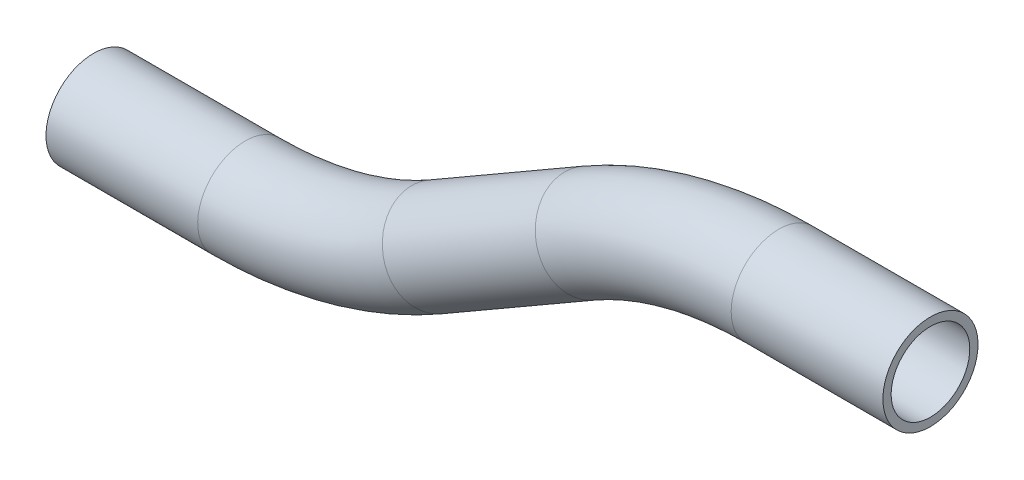
ISO-10303-21;
HEADER;
FILE_DESCRIPTION(('STEP AP214'),'2;1');
FILE_NAME('part.step','',(''),(''),'','','');
FILE_SCHEMA(('AUTOMOTIVE_DESIGN { 1 0 10303 214 1 1 1 1 }'));
ENDSEC;
DATA;
#1=APPLICATION_CONTEXT('core data for automotive mechanical design processes');
#2=APPLICATION_PROTOCOL_DEFINITION('international standard','automotive_design',2000,#1);
#3=PRODUCT_CONTEXT('',#1,'mechanical');
#4=PRODUCT('Part','Part','',(#3));
#5=PRODUCT_RELATED_PRODUCT_CATEGORY('part','',(#4));
#6=PRODUCT_DEFINITION_FORMATION('','',#4);
#7=PRODUCT_DEFINITION_CONTEXT('part definition',#1,'design');
#8=PRODUCT_DEFINITION('design','',#6,#7);
#9=PRODUCT_DEFINITION_SHAPE('','',#8);
#10=(LENGTH_UNIT() NAMED_UNIT(*) SI_UNIT(.MILLI.,.METRE.));
#11=(NAMED_UNIT(*) PLANE_ANGLE_UNIT() SI_UNIT($,.RADIAN.));
#12=(NAMED_UNIT(*) SI_UNIT($,.STERADIAN.) SOLID_ANGLE_UNIT());
#13=UNCERTAINTY_MEASURE_WITH_UNIT(LENGTH_MEASURE(1.E-05),#10,'distance_accuracy_value','');
#14=(GEOMETRIC_REPRESENTATION_CONTEXT(3) GLOBAL_UNCERTAINTY_ASSIGNED_CONTEXT((#13)) GLOBAL_UNIT_ASSIGNED_CONTEXT((#10,
#11,#12)) REPRESENTATION_CONTEXT('',''));
#15=CARTESIAN_POINT('',(0.,0.,0.));
#16=DIRECTION('',(0.,0.,1.));
#17=DIRECTION('',(1.,0.,0.));
#18=AXIS2_PLACEMENT_3D('',#15,#16,#17);
#19=CARTESIAN_POINT('',(30.3822715367483,0.,0.));
#20=DIRECTION('',(-1.,0.,0.));
#21=DIRECTION('',(0.,-1.,0.));
#22=AXIS2_PLACEMENT_3D('',#19,#20,#21);
#23=CYLINDRICAL_SURFACE('',#22,9.525);
#24=CARTESIAN_POINT('',(0.,0.,0.));
#25=DIRECTION('',(-1.,0.,0.));
#26=DIRECTION('',(0.,-1.,0.));
#27=AXIS2_PLACEMENT_3D('',#24,#25,#26);
#28=CIRCLE('',#27,9.525);
#29=CARTESIAN_POINT('',(0.,9.52499999999999,0.));
#30=VERTEX_POINT('',#29);
#31=EDGE_CURVE('E67',#30,#30,#28,.T.);
#32=ORIENTED_EDGE('',*,*,#31,.F.);
#33=EDGE_LOOP('',(#32));
#34=FACE_BOUND('',#33,.T.);
#35=CARTESIAN_POINT('',(30.3822715367483,0.,0.));
#36=DIRECTION('',(-1.,0.,0.));
#37=DIRECTION('',(0.,-1.,0.));
#38=AXIS2_PLACEMENT_3D('',#35,#36,#37);
#39=CIRCLE('',#38,9.525);
#40=CARTESIAN_POINT('',(30.3822715367483,-9.525,0.));
#41=VERTEX_POINT('',#40);
#42=EDGE_CURVE('E63',#41,#41,#39,.T.);
#43=ORIENTED_EDGE('',*,*,#42,.T.);
#44=EDGE_LOOP('',(#43));
#45=FACE_BOUND('',#44,.T.);
#46=ADVANCED_FACE('F39',(#34,#45),#23,.T.);
#47=CARTESIAN_POINT('',(0.,-76.2,0.));
#48=DIRECTION('',(0.,0.,1.));
#49=DIRECTION('',(1.,0.,0.));
#50=AXIS2_PLACEMENT_3D('',#47,#48,#49);
#51=TOROIDAL_SURFACE('',#50,76.2,9.525);
#52=CARTESIAN_POINT('',(-38.1000000000001,-10.2088642316259,0.));
#53=DIRECTION('',(-0.866025403784438,-0.500000000000002,0.));
#54=DIRECTION('',(0.500000000000002,-0.866025403784438,0.));
#55=AXIS2_PLACEMENT_3D('',#52,#53,#54);
#56=CIRCLE('',#55,9.525);
#57=CARTESIAN_POINT('',(-42.8625000000002,-1.95997226057908,0.));
#58=VERTEX_POINT('',#57);
#59=EDGE_CURVE('E71',#58,#58,#56,.T.);
#60=CARTESIAN_POINT('',(0.,-76.2,0.));
#61=DIRECTION('',(0.,0.,1.));
#62=DIRECTION('',(1.,0.,0.));
#63=AXIS2_PLACEMENT_3D('',#60,#61,#62);
#64=CIRCLE('',#63,85.725);
#65=EDGE_CURVE('',#30,#58,#64,.T.);
#66=ORIENTED_EDGE('',*,*,#31,.T.);
#67=ORIENTED_EDGE('',*,*,#59,.F.);
#68=ORIENTED_EDGE('',*,*,#65,.T.);
#69=ORIENTED_EDGE('',*,*,#65,.F.);
#70=EDGE_LOOP('',(#66,#68,#67,#69));
#71=FACE_BOUND('',#70,.T.);
#72=ADVANCED_FACE('F93',(#71),#51,.T.);
#73=CARTESIAN_POINT('',(-38.1000000000001,-10.2088642316259,0.));
#74=DIRECTION('',(-0.866025403784438,-0.500000000000001,0.));
#75=DIRECTION('',(0.500000000000001,-0.866025403784438,0.));
#76=AXIS2_PLACEMENT_3D('',#73,#74,#75);
#77=CYLINDRICAL_SURFACE('',#76,9.525);
#78=CARTESIAN_POINT('',(-68.7265926948774,-27.8911357683743,0.));
#79=DIRECTION('',(-0.866025403784438,-0.500000000000001,0.));
#80=DIRECTION('',(0.500000000000001,-0.866025403784438,0.));
#81=AXIS2_PLACEMENT_3D('',#78,#79,#80);
#82=CIRCLE('',#81,9.525);
#83=CARTESIAN_POINT('',(-63.9640926948773,-36.1400277394211,0.));
#84=VERTEX_POINT('',#83);
#85=EDGE_CURVE('E74',#84,#84,#82,.T.);
#86=ORIENTED_EDGE('',*,*,#85,.F.);
#87=EDGE_LOOP('',(#86));
#88=FACE_BOUND('',#87,.T.);
#89=ORIENTED_EDGE('',*,*,#59,.T.);
#90=EDGE_LOOP('',(#89));
#91=FACE_BOUND('',#90,.T.);
#92=ADVANCED_FACE('F86',(#88,#91),#77,.T.);
#93=CARTESIAN_POINT('',(-106.826592694877,38.0999999999999,0.));
#94=DIRECTION('',(0.,0.,-1.));
#95=DIRECTION('',(-1.,0.,0.));
#96=AXIS2_PLACEMENT_3D('',#93,#94,#95);
#97=TOROIDAL_SURFACE('',#96,76.2,9.525);
#98=CARTESIAN_POINT('',(-106.826592694877,-38.1000000000002,0.));
#99=DIRECTION('',(-1.,0.,0.));
#100=DIRECTION('',(0.,-1.,0.));
#101=AXIS2_PLACEMENT_3D('',#98,#99,#100);
#102=CIRCLE('',#101,9.525);
#103=CARTESIAN_POINT('',(-106.826592694877,-47.6250000000001,0.));
#104=VERTEX_POINT('',#103);
#105=EDGE_CURVE('E43',#104,#104,#102,.T.);
#106=CARTESIAN_POINT('',(-106.826592694877,38.0999999999999,0.));
#107=DIRECTION('',(0.,0.,-1.));
#108=DIRECTION('',(-1.,0.,0.));
#109=AXIS2_PLACEMENT_3D('',#106,#107,#108);
#110=CIRCLE('',#109,85.725);
#111=EDGE_CURVE('',#84,#104,#110,.T.);
#112=ORIENTED_EDGE('',*,*,#85,.T.);
#113=ORIENTED_EDGE('',*,*,#105,.F.);
#114=ORIENTED_EDGE('',*,*,#111,.T.);
#115=ORIENTED_EDGE('',*,*,#111,.F.);
#116=EDGE_LOOP('',(#112,#114,#113,#115));
#117=FACE_BOUND('',#116,.T.);
#118=ADVANCED_FACE('F84',(#117),#97,.T.);
#119=CARTESIAN_POINT('',(-106.826592694877,-38.1000000000002,0.));
#120=DIRECTION('',(-1.,0.,0.));
#121=DIRECTION('',(0.,-1.,0.));
#122=AXIS2_PLACEMENT_3D('',#119,#120,#121);
#123=CYLINDRICAL_SURFACE('',#122,9.525);
#124=CARTESIAN_POINT('',(-137.208864231626,-38.1000000000002,0.));
#125=DIRECTION('',(-1.,0.,0.));
#126=DIRECTION('',(0.,-1.,0.));
#127=AXIS2_PLACEMENT_3D('',#124,#125,#126);
#128=CIRCLE('',#127,9.525);
#129=CARTESIAN_POINT('',(-137.208864231626,-47.6250000000002,0.));
#130=VERTEX_POINT('',#129);
#131=EDGE_CURVE('E58',#130,#130,#128,.T.);
#132=ORIENTED_EDGE('',*,*,#131,.F.);
#133=EDGE_LOOP('',(#132));
#134=FACE_BOUND('',#133,.T.);
#135=ORIENTED_EDGE('',*,*,#105,.T.);
#136=EDGE_LOOP('',(#135));
#137=FACE_BOUND('',#136,.T.);
#138=ADVANCED_FACE('F41',(#134,#137),#123,.T.);
#139=CARTESIAN_POINT('',(30.3822715367483,0.,0.));
#140=DIRECTION('',(-1.,0.,0.));
#141=DIRECTION('',(0.,-1.,0.));
#142=AXIS2_PLACEMENT_3D('',#139,#140,#141);
#143=PLANE('',#142);
#144=CARTESIAN_POINT('',(30.3822715367483,0.,0.));
#145=DIRECTION('',(-1.,0.,0.));
#146=DIRECTION('',(0.,-1.,0.));
#147=AXIS2_PLACEMENT_3D('',#144,#145,#146);
#148=CIRCLE('',#147,7.874);
#149=CARTESIAN_POINT('',(30.3822715367483,-7.874,0.));
#150=VERTEX_POINT('',#149);
#151=EDGE_CURVE('E62',#150,#150,#148,.F.);
#152=ORIENTED_EDGE('',*,*,#151,.F.);
#153=EDGE_LOOP('',(#152));
#154=FACE_BOUND('',#153,.T.);
#155=ORIENTED_EDGE('',*,*,#42,.F.);
#156=EDGE_LOOP('',(#155));
#157=FACE_BOUND('',#156,.T.);
#158=ADVANCED_FACE('F91',(#154,#157),#143,.F.);
#159=CARTESIAN_POINT('',(-137.208864231626,-38.1000000000002,0.));
#160=DIRECTION('',(-1.,0.,0.));
#161=DIRECTION('',(0.,-1.,0.));
#162=AXIS2_PLACEMENT_3D('',#159,#160,#161);
#163=PLANE('',#162);
#164=CARTESIAN_POINT('',(-137.208864231626,-38.1000000000002,0.));
#165=DIRECTION('',(-1.,0.,0.));
#166=DIRECTION('',(0.,-1.,0.));
#167=AXIS2_PLACEMENT_3D('',#164,#165,#166);
#168=CIRCLE('',#167,7.874);
#169=CARTESIAN_POINT('',(-137.208864231626,-45.9740000000002,0.));
#170=VERTEX_POINT('',#169);
#171=EDGE_CURVE('E10',#170,#170,#168,.F.);
#172=ORIENTED_EDGE('',*,*,#171,.T.);
#173=EDGE_LOOP('',(#172));
#174=FACE_BOUND('',#173,.T.);
#175=ORIENTED_EDGE('',*,*,#131,.T.);
#176=EDGE_LOOP('',(#175));
#177=FACE_BOUND('',#176,.T.);
#178=ADVANCED_FACE('F110',(#174,#177),#163,.T.);
#179=CARTESIAN_POINT('',(30.3822715367483,0.,0.));
#180=DIRECTION('',(-1.,0.,0.));
#181=DIRECTION('',(0.,-1.,0.));
#182=AXIS2_PLACEMENT_3D('',#179,#180,#181);
#183=CYLINDRICAL_SURFACE('',#182,7.874);
#184=CARTESIAN_POINT('',(0.,0.,0.));
#185=DIRECTION('',(-1.,0.,0.));
#186=DIRECTION('',(0.,-1.,0.));
#187=AXIS2_PLACEMENT_3D('',#184,#185,#186);
#188=CIRCLE('',#187,7.874);
#189=CARTESIAN_POINT('',(0.,7.87399999999999,0.));
#190=VERTEX_POINT('',#189);
#191=EDGE_CURVE('E209',#190,#190,#188,.F.);
#192=ORIENTED_EDGE('',*,*,#191,.F.);
#193=EDGE_LOOP('',(#192));
#194=FACE_BOUND('',#193,.T.);
#195=ORIENTED_EDGE('',*,*,#151,.T.);
#196=EDGE_LOOP('',(#195));
#197=FACE_BOUND('',#196,.T.);
#198=ADVANCED_FACE('F113',(#194,#197),#183,.F.);
#199=CARTESIAN_POINT('',(0.,-76.2,0.));
#200=DIRECTION('',(0.,0.,1.));
#201=DIRECTION('',(1.,0.,0.));
#202=AXIS2_PLACEMENT_3D('',#199,#200,#201);
#203=TOROIDAL_SURFACE('',#202,76.2,7.874);
#204=CARTESIAN_POINT('',(-38.1000000000001,-10.2088642316259,0.));
#205=DIRECTION('',(-0.866025403784438,-0.500000000000002,0.));
#206=DIRECTION('',(0.500000000000002,-0.866025403784438,0.));
#207=AXIS2_PLACEMENT_3D('',#204,#205,#206);
#208=CIRCLE('',#207,7.874);
#209=CARTESIAN_POINT('',(-42.0370000000001,-3.38978020222719,0.));
#210=VERTEX_POINT('',#209);
#211=EDGE_CURVE('E207',#210,#210,#208,.F.);
#212=CARTESIAN_POINT('',(0.,-76.2,0.));
#213=DIRECTION('',(0.,0.,1.));
#214=DIRECTION('',(1.,0.,0.));
#215=AXIS2_PLACEMENT_3D('',#212,#213,#214);
#216=CIRCLE('',#215,84.074);
#217=EDGE_CURVE('',#190,#210,#216,.T.);
#218=ORIENTED_EDGE('',*,*,#191,.T.);
#219=ORIENTED_EDGE('',*,*,#211,.F.);
#220=ORIENTED_EDGE('',*,*,#217,.T.);
#221=ORIENTED_EDGE('',*,*,#217,.F.);
#222=EDGE_LOOP('',(#218,#220,#219,#221));
#223=FACE_BOUND('',#222,.T.);
#224=ADVANCED_FACE('F170',(#223),#203,.F.);
#225=CARTESIAN_POINT('',(-38.1000000000001,-10.2088642316259,0.));
#226=DIRECTION('',(-0.866025403784438,-0.500000000000001,0.));
#227=DIRECTION('',(0.500000000000001,-0.866025403784438,0.));
#228=AXIS2_PLACEMENT_3D('',#225,#226,#227);
#229=CYLINDRICAL_SURFACE('',#228,7.874);
#230=CARTESIAN_POINT('',(-68.7265926948774,-27.8911357683743,0.));
#231=DIRECTION('',(-0.866025403784438,-0.500000000000001,0.));
#232=DIRECTION('',(0.500000000000001,-0.866025403784438,0.));
#233=AXIS2_PLACEMENT_3D('',#230,#231,#232);
#234=CIRCLE('',#233,7.874);
#235=CARTESIAN_POINT('',(-64.7895926948773,-34.710219797773,0.));
#236=VERTEX_POINT('',#235);
#237=EDGE_CURVE('E54',#236,#236,#234,.F.);
#238=ORIENTED_EDGE('',*,*,#237,.F.);
#239=EDGE_LOOP('',(#238));
#240=FACE_BOUND('',#239,.T.);
#241=ORIENTED_EDGE('',*,*,#211,.T.);
#242=EDGE_LOOP('',(#241));
#243=FACE_BOUND('',#242,.T.);
#244=ADVANCED_FACE('F104',(#240,#243),#229,.F.);
#245=CARTESIAN_POINT('',(-106.826592694877,38.0999999999999,0.));
#246=DIRECTION('',(0.,0.,-1.));
#247=DIRECTION('',(-1.,0.,0.));
#248=AXIS2_PLACEMENT_3D('',#245,#246,#247);
#249=TOROIDAL_SURFACE('',#248,76.2,7.874);
#250=CARTESIAN_POINT('',(-106.826592694877,-38.1000000000002,0.));
#251=DIRECTION('',(-1.,0.,0.));
#252=DIRECTION('',(0.,-1.,0.));
#253=AXIS2_PLACEMENT_3D('',#250,#251,#252);
#254=CIRCLE('',#253,7.874);
#255=CARTESIAN_POINT('',(-106.826592694877,-45.9740000000001,0.));
#256=VERTEX_POINT('',#255);
#257=EDGE_CURVE('E48',#256,#256,#254,.F.);
#258=CARTESIAN_POINT('',(-106.826592694877,38.0999999999999,0.));
#259=DIRECTION('',(0.,0.,-1.));
#260=DIRECTION('',(-1.,0.,0.));
#261=AXIS2_PLACEMENT_3D('',#258,#259,#260);
#262=CIRCLE('',#261,84.074);
#263=EDGE_CURVE('',#236,#256,#262,.T.);
#264=ORIENTED_EDGE('',*,*,#237,.T.);
#265=ORIENTED_EDGE('',*,*,#257,.F.);
#266=ORIENTED_EDGE('',*,*,#263,.T.);
#267=ORIENTED_EDGE('',*,*,#263,.F.);
#268=EDGE_LOOP('',(#264,#266,#265,#267));
#269=FACE_BOUND('',#268,.T.);
#270=ADVANCED_FACE('F98',(#269),#249,.F.);
#271=CARTESIAN_POINT('',(-106.826592694877,-38.1000000000002,0.));
#272=DIRECTION('',(-1.,0.,0.));
#273=DIRECTION('',(0.,-1.,0.));
#274=AXIS2_PLACEMENT_3D('',#271,#272,#273);
#275=CYLINDRICAL_SURFACE('',#274,7.874);
#276=ORIENTED_EDGE('',*,*,#171,.F.);
#277=EDGE_LOOP('',(#276));
#278=FACE_BOUND('',#277,.T.);
#279=ORIENTED_EDGE('',*,*,#257,.T.);
#280=EDGE_LOOP('',(#279));
#281=FACE_BOUND('',#280,.T.);
#282=ADVANCED_FACE('F96',(#278,#281),#275,.F.);
#283=CLOSED_SHELL('',(#46,#72,#92,#118,#138,#158,#178,#198,#224,#244,#270,#282));
#284=MANIFOLD_SOLID_BREP('B2',#283);
#285=ADVANCED_BREP_SHAPE_REPRESENTATION('',(#18,#284),#14);
#286=SHAPE_DEFINITION_REPRESENTATION(#9,#285);
ENDSEC;
END-ISO-10303-21;
